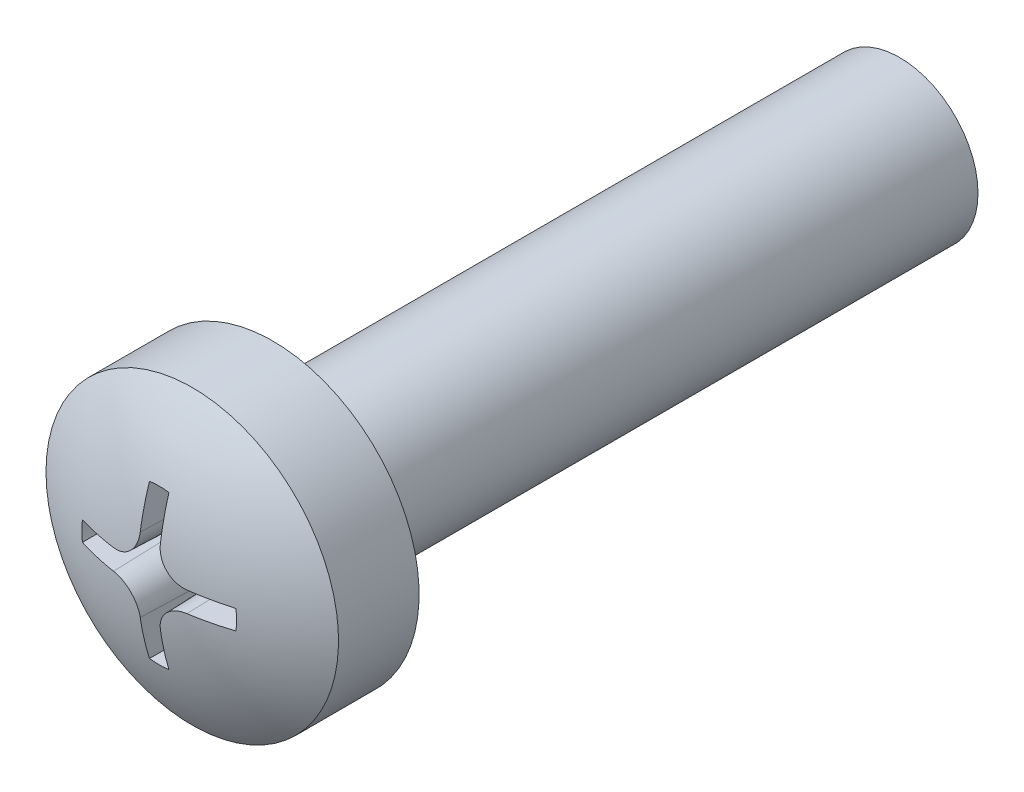
ISO-10303-21;
HEADER;
FILE_DESCRIPTION(('STEP AP214'),'2;1');
FILE_NAME('part.step','',(''),(''),'','','');
FILE_SCHEMA(('AUTOMOTIVE_DESIGN { 1 0 10303 214 1 1 1 1 }'));
ENDSEC;
DATA;
#1=APPLICATION_CONTEXT('core data for automotive mechanical design processes');
#2=APPLICATION_PROTOCOL_DEFINITION('international standard','automotive_design',2000,#1);
#3=PRODUCT_CONTEXT('',#1,'mechanical');
#4=PRODUCT('Part','Part','',(#3));
#5=PRODUCT_RELATED_PRODUCT_CATEGORY('part','',(#4));
#6=PRODUCT_DEFINITION_FORMATION('','',#4);
#7=PRODUCT_DEFINITION_CONTEXT('part definition',#1,'design');
#8=PRODUCT_DEFINITION('design','',#6,#7);
#9=PRODUCT_DEFINITION_SHAPE('','',#8);
#10=(LENGTH_UNIT() NAMED_UNIT(*) SI_UNIT(.MILLI.,.METRE.));
#11=(NAMED_UNIT(*) PLANE_ANGLE_UNIT() SI_UNIT($,.RADIAN.));
#12=(NAMED_UNIT(*) SI_UNIT($,.STERADIAN.) SOLID_ANGLE_UNIT());
#13=UNCERTAINTY_MEASURE_WITH_UNIT(LENGTH_MEASURE(1.E-05),#10,'distance_accuracy_value','');
#14=(GEOMETRIC_REPRESENTATION_CONTEXT(3) GLOBAL_UNCERTAINTY_ASSIGNED_CONTEXT((#13)) GLOBAL_UNIT_ASSIGNED_CONTEXT((#10,
#11,#12)) REPRESENTATION_CONTEXT('',''));
#15=CARTESIAN_POINT('',(0.,0.,0.));
#16=DIRECTION('',(0.,0.,1.));
#17=DIRECTION('',(1.,0.,0.));
#18=AXIS2_PLACEMENT_3D('',#15,#16,#17);
#19=CARTESIAN_POINT('',(0.,0.,12.));
#20=DIRECTION('',(0.,0.,-1.));
#21=DIRECTION('',(-1.,0.,0.));
#22=AXIS2_PLACEMENT_3D('',#19,#20,#21);
#23=CYLINDRICAL_SURFACE('',#22,1.5);
#24=CARTESIAN_POINT('',(0.,0.,12.));
#25=DIRECTION('',(0.,0.,1.));
#26=DIRECTION('',(1.,0.,0.));
#27=AXIS2_PLACEMENT_3D('',#24,#25,#26);
#28=CIRCLE('',#27,1.5);
#29=CARTESIAN_POINT('',(1.5,0.,12.));
#30=VERTEX_POINT('',#29);
#31=EDGE_CURVE('E208',#30,#30,#28,.T.);
#32=ORIENTED_EDGE('',*,*,#31,.F.);
#33=EDGE_LOOP('',(#32));
#34=FACE_BOUND('',#33,.T.);
#35=CARTESIAN_POINT('',(0.,0.,-0.0001));
#36=DIRECTION('',(0.,0.,1.));
#37=DIRECTION('',(1.,0.,0.));
#38=AXIS2_PLACEMENT_3D('',#35,#36,#37);
#39=CIRCLE('',#38,1.5);
#40=CARTESIAN_POINT('',(1.5,0.,-0.0001));
#41=VERTEX_POINT('',#40);
#42=EDGE_CURVE('E205',#41,#41,#39,.T.);
#43=ORIENTED_EDGE('',*,*,#42,.T.);
#44=EDGE_LOOP('',(#43));
#45=FACE_BOUND('',#44,.T.);
#46=ADVANCED_FACE('F34',(#34,#45),#23,.T.);
#47=CARTESIAN_POINT('',(0.,0.,-0.0001));
#48=DIRECTION('',(0.,0.,1.));
#49=DIRECTION('',(1.,0.,0.));
#50=AXIS2_PLACEMENT_3D('',#47,#48,#49);
#51=PLANE('',#50);
#52=ORIENTED_EDGE('',*,*,#42,.F.);
#53=EDGE_LOOP('',(#52));
#54=FACE_BOUND('',#53,.T.);
#55=ADVANCED_FACE('F295',(#54),#51,.F.);
#56=CARTESIAN_POINT('',(0.,0.,12.));
#57=DIRECTION('',(0.,0.,-1.));
#58=DIRECTION('',(-1.,0.,0.));
#59=AXIS2_PLACEMENT_3D('',#56,#57,#58);
#60=PLANE('',#59);
#61=ORIENTED_EDGE('',*,*,#31,.T.);
#62=EDGE_LOOP('',(#61));
#63=FACE_BOUND('',#62,.T.);
#64=CARTESIAN_POINT('',(0.,0.,12.));
#65=DIRECTION('',(0.,0.,-1.));
#66=DIRECTION('',(-1.,0.,0.));
#67=AXIS2_PLACEMENT_3D('',#64,#65,#66);
#68=CIRCLE('',#67,2.79999990016222);
#69=CARTESIAN_POINT('',(-2.79999990016222,0.,12.));
#70=VERTEX_POINT('',#69);
#71=EDGE_CURVE('E202',#70,#70,#68,.T.);
#72=ORIENTED_EDGE('',*,*,#71,.T.);
#73=EDGE_LOOP('',(#72));
#74=FACE_BOUND('',#73,.T.);
#75=ADVANCED_FACE('F300',(#63,#74),#60,.T.);
#76=CARTESIAN_POINT('',(0.,0.,-0.393620134621003));
#77=DIRECTION('',(0.,0.,-1.));
#78=DIRECTION('',(-1.,0.,0.));
#79=AXIS2_PLACEMENT_3D('',#76,#77,#78);
#80=CYLINDRICAL_SURFACE('',#79,2.79999990016222);
#81=CARTESIAN_POINT('',(0.,0.,13.5424630797893));
#82=DIRECTION('',(0.,0.,-1.));
#83=DIRECTION('',(-1.,0.,0.));
#84=AXIS2_PLACEMENT_3D('',#81,#82,#83);
#85=CIRCLE('',#84,2.79999990016222);
#86=CARTESIAN_POINT('',(-2.79999990016222,0.,13.5424630797893));
#87=VERTEX_POINT('',#86);
#88=EDGE_CURVE('E150',#87,#87,#85,.T.);
#89=ORIENTED_EDGE('',*,*,#88,.T.);
#90=EDGE_LOOP('',(#89));
#91=FACE_BOUND('',#90,.T.);
#92=ORIENTED_EDGE('',*,*,#71,.F.);
#93=EDGE_LOOP('',(#92));
#94=FACE_BOUND('',#93,.T.);
#95=ADVANCED_FACE('F308',(#91,#94),#80,.T.);
#96=CARTESIAN_POINT('',(0.,0.,9.40000011175871));
#97=DIRECTION('',(0.,0.,-1.));
#98=DIRECTION('',(1.,0.,0.));
#99=AXIS2_PLACEMENT_3D('',#96,#97,#98);
#100=SPHERICAL_SURFACE('',#99,4.99999988824129);
#101=CARTESIAN_POINT('',(0.,0.,14.1754183821502));
#102=DIRECTION('',(0.,0.,-1.));
#103=DIRECTION('',(-1.,0.,0.));
#104=AXIS2_PLACEMENT_3D('',#101,#102,#103);
#105=CIRCLE('',#104,1.4816812157899);
#106=CARTESIAN_POINT('',(0.18668120666759,1.46987392394782,14.1754183821501));
#107=VERTEX_POINT('',#106);
#108=CARTESIAN_POINT('',(-0.186681206667593,1.46987392394782,14.1754183821501));
#109=VERTEX_POINT('',#108);
#110=EDGE_CURVE('E11',#107,#109,#105,.F.);
#111=ORIENTED_EDGE('',*,*,#110,.F.);
#112=CARTESIAN_POINT('',(0.0198956640512633,0.,9.39930533986049));
#113=DIRECTION('',(0.999390827019096,0.,-0.034899496702501));
#114=DIRECTION('',(-0.034899496702501,0.,-0.999390827019096));
#115=AXIS2_PLACEMENT_3D('',#112,#113,#114);
#116=CIRCLE('',#115,4.99996025606773);
#117=CARTESIAN_POINT('',(0.192632610704328,0.708178557647151,14.3458442955351));
#118=VERTEX_POINT('',#117);
#119=EDGE_CURVE('E41',#107,#118,#116,.T.);
#120=ORIENTED_EDGE('',*,*,#119,.T.);
#121=CARTESIAN_POINT('',(0.192631650862954,0.708378557647151,14.345815691475));
#122=CARTESIAN_POINT('',(0.192737639690806,0.679822741796073,14.3499041439734));
#123=CARTESIAN_POINT('',(0.195268867839181,0.651227392830896,14.3536463362414));
#124=CARTESIAN_POINT('',(0.205046889209158,0.59476703827459,14.3603460551712));
#125=CARTESIAN_POINT('',(0.212292618678018,0.566901869404939,14.3633037586285));
#126=CARTESIAN_POINT('',(0.231373694375068,0.51267267841366,14.3683466063254));
#127=CARTESIAN_POINT('',(0.24321326807329,0.486310064716558,14.3704309431667));
#128=CARTESIAN_POINT('',(0.271156607880554,0.435900324544809,14.3736603491012));
#129=CARTESIAN_POINT('',(0.287258672100205,0.411852279143786,14.3748057923215));
#130=CARTESIAN_POINT('',(0.323072075489885,0.367028886470806,14.3761158025717));
#131=CARTESIAN_POINT('',(0.342740648168188,0.346219679514825,14.3762912893596));
#132=CARTESIAN_POINT('',(0.385246757538768,0.30814670944778,14.3756853456951));
#133=CARTESIAN_POINT('',(0.408084792807392,0.290883505206881,14.3749037645383));
#134=CARTESIAN_POINT('',(0.456147210008961,0.260464262414973,14.3724133951705));
#135=CARTESIAN_POINT('',(0.481359759209805,0.247289131136679,14.3707090224733));
#136=CARTESIAN_POINT('',(0.533541444049374,0.225283958921734,14.3664258870809));
#137=CARTESIAN_POINT('',(0.560509920861877,0.216452298826715,14.3638474508254));
#138=CARTESIAN_POINT('',(0.606876295057338,0.205379627868596,14.3588207651558));
#139=CARTESIAN_POINT('',(0.626020977094074,0.201943221890059,14.3565812960749));
#140=CARTESIAN_POINT('',(0.66450204404321,0.197253494550336,14.3517582366185));
#141=CARTESIAN_POINT('',(0.683838077649067,0.195996727127303,14.349175196413));
#142=CARTESIAN_POINT('',(0.703167546290468,0.195835015722445,14.3464334662955));
#143=B_SPLINE_CURVE_WITH_KNOTS('',3,(#121,#122,#123,#124,#125,#126,#127,#128,#129,#130,#131,
#132,#133,#134,#135,#136,#137,#138,#139,#140,#141,#142),.UNSPECIFIED.,.F.,.F.,(4,2,2,2,2,2,2,2,
2,2,4),(0.,0.0864417829586744,0.172864068455127,0.259366073122684,0.345833591994609,
0.431325646912079,0.516831165542016,0.601931114274005,0.686999315371811,0.745618262708562,
0.804144447281415),.UNSPECIFIED.);
#144=CARTESIAN_POINT('',(0.702917362553185,0.19583721033533,14.3464689381926));
#145=VERTEX_POINT('',#144);
#146=EDGE_CURVE('E277',#118,#145,#143,.T.);
#147=ORIENTED_EDGE('',*,*,#146,.T.);
#148=CARTESIAN_POINT('',(0.000105390153350327,0.0259265633149154,9.39909472873738));
#149=DIRECTION('',(0.00406243901494415,0.999382570249833,-0.034899496702501));
#150=DIRECTION('',(0.,0.0348997846864301,0.999390816962434));
#151=AXIS2_PLACEMENT_3D('',#148,#149,#150);
#152=CIRCLE('',#151,4.99993258603575);
#153=CARTESIAN_POINT('',(1.46986565043204,0.186746338396853,14.1754183821502));
#154=VERTEX_POINT('',#153);
#155=EDGE_CURVE('E275',#154,#145,#152,.F.);
#156=ORIENTED_EDGE('',*,*,#155,.F.);
#157=CARTESIAN_POINT('',(0.,0.,14.1754183821502));
#158=DIRECTION('',(0.,0.,-1.));
#159=DIRECTION('',(-1.,0.,0.));
#160=AXIS2_PLACEMENT_3D('',#157,#158,#159);
#161=CIRCLE('',#160,1.4816812157899);
#162=CARTESIAN_POINT('',(1.46986565043204,-0.186746338396852,14.1754183821501));
#163=VERTEX_POINT('',#162);
#164=EDGE_CURVE('E273',#163,#154,#161,.F.);
#165=ORIENTED_EDGE('',*,*,#164,.F.);
#166=CARTESIAN_POINT('',(0.000105390153350358,-0.0259265633149169,9.39909472873738));
#167=DIRECTION('',(0.00406243901494512,-0.999382570249833,-0.034899496702501));
#168=DIRECTION('',(0.,0.0348997846864301,-0.999390816962434));
#169=AXIS2_PLACEMENT_3D('',#166,#167,#168);
#170=CIRCLE('',#169,4.99993258603575);
#171=CARTESIAN_POINT('',(0.702917362553185,-0.195837210335331,14.3464689381926));
#172=VERTEX_POINT('',#171);
#173=EDGE_CURVE('E270',#163,#172,#170,.T.);
#174=ORIENTED_EDGE('',*,*,#173,.T.);
#175=CARTESIAN_POINT('',(0.192631650862954,-0.708378557647152,14.345815691475));
#176=CARTESIAN_POINT('',(0.192737639690806,-0.679822741796074,14.3499041439734));
#177=CARTESIAN_POINT('',(0.195268867839181,-0.651227392830896,14.3536463362414));
#178=CARTESIAN_POINT('',(0.205046889209158,-0.59476703827459,14.3603460551712));
#179=CARTESIAN_POINT('',(0.212292618678018,-0.56690186940494,14.3633037586285));
#180=CARTESIAN_POINT('',(0.231373694375068,-0.512672678413661,14.3683466063254));
#181=CARTESIAN_POINT('',(0.24321326807329,-0.486310064716559,14.3704309431667));
#182=CARTESIAN_POINT('',(0.271156607880554,-0.435900324544809,14.3736603491012));
#183=CARTESIAN_POINT('',(0.287258672100205,-0.411852279143786,14.3748057923215));
#184=CARTESIAN_POINT('',(0.323072075489885,-0.367028886470807,14.3761158025717));
#185=CARTESIAN_POINT('',(0.342740648168188,-0.346219679514826,14.3762912893596));
#186=CARTESIAN_POINT('',(0.385246757538768,-0.308146709447781,14.3756853456951));
#187=CARTESIAN_POINT('',(0.408084792807392,-0.290883505206882,14.3749037645383));
#188=CARTESIAN_POINT('',(0.456147210008961,-0.260464262414974,14.3724133951705));
#189=CARTESIAN_POINT('',(0.481359759209805,-0.247289131136679,14.3707090224733));
#190=CARTESIAN_POINT('',(0.533541444049374,-0.225283958921735,14.3664258870809));
#191=CARTESIAN_POINT('',(0.560509920861878,-0.216452298826716,14.3638474508254));
#192=CARTESIAN_POINT('',(0.606876295057338,-0.205379627868597,14.3588207651558));
#193=CARTESIAN_POINT('',(0.626020977094074,-0.201943221890059,14.3565812960749));
#194=CARTESIAN_POINT('',(0.66450204404321,-0.197253494550336,14.3517582366185));
#195=CARTESIAN_POINT('',(0.683838077649067,-0.195996727127304,14.349175196413));
#196=CARTESIAN_POINT('',(0.703167546290467,-0.195835015722445,14.3464334662955));
#197=B_SPLINE_CURVE_WITH_KNOTS('',3,(#175,#176,#177,#178,#179,#180,#181,#182,#183,#184,#185,
#186,#187,#188,#189,#190,#191,#192,#193,#194,#195,#196),.UNSPECIFIED.,.F.,.F.,(4,2,2,2,2,2,2,2,
2,2,4),(0.,0.0864417829586746,0.172864068455127,0.259366073122684,0.345833591994609,
0.431325646912079,0.516831165542017,0.601931114274005,0.686999315371811,0.745618262708562,
0.804144447281414),.UNSPECIFIED.);
#198=CARTESIAN_POINT('',(0.192632610704328,-0.708178557647152,14.3458442955351));
#199=VERTEX_POINT('',#198);
#200=EDGE_CURVE('E264',#199,#172,#197,.T.);
#201=ORIENTED_EDGE('',*,*,#200,.F.);
#202=CARTESIAN_POINT('',(0.0198956640512633,0.,9.39930533986049));
#203=DIRECTION('',(0.999390827019096,0.,-0.034899496702501));
#204=DIRECTION('',(-0.034899496702501,0.,-0.999390827019096));
#205=AXIS2_PLACEMENT_3D('',#202,#203,#204);
#206=CIRCLE('',#205,4.99996025606773);
#207=CARTESIAN_POINT('',(0.186681206667591,-1.46987392394782,14.1754183821502));
#208=VERTEX_POINT('',#207);
#209=EDGE_CURVE('E262',#208,#199,#206,.F.);
#210=ORIENTED_EDGE('',*,*,#209,.F.);
#211=CARTESIAN_POINT('',(0.,0.,14.1754183821502));
#212=DIRECTION('',(0.,0.,-1.));
#213=DIRECTION('',(-1.,0.,0.));
#214=AXIS2_PLACEMENT_3D('',#211,#212,#213);
#215=CIRCLE('',#214,1.4816812157899);
#216=CARTESIAN_POINT('',(-0.186681206667593,-1.46987392394782,14.1754183821501));
#217=VERTEX_POINT('',#216);
#218=EDGE_CURVE('E259',#208,#217,#215,.T.);
#219=ORIENTED_EDGE('',*,*,#218,.T.);
#220=CARTESIAN_POINT('',(-0.0198956640512654,0.,9.39930533986049));
#221=DIRECTION('',(-0.999390827019096,0.,-0.034899496702501));
#222=DIRECTION('',(-0.034899496702501,0.,0.999390827019096));
#223=AXIS2_PLACEMENT_3D('',#220,#221,#222);
#224=CIRCLE('',#223,4.99996025606773);
#225=CARTESIAN_POINT('',(-0.19263261070433,-0.708178557647151,14.3458442955351));
#226=VERTEX_POINT('',#225);
#227=EDGE_CURVE('E255',#217,#226,#224,.T.);
#228=ORIENTED_EDGE('',*,*,#227,.T.);
#229=CARTESIAN_POINT('',(-0.703167546290469,-0.195835015722445,14.3464334662955));
#230=CARTESIAN_POINT('',(-0.674619447950853,-0.196052963217916,14.3504857241648));
#231=CARTESIAN_POINT('',(-0.646041434637229,-0.198695168407334,14.3541890416191));
#232=CARTESIAN_POINT('',(-0.589634494727846,-0.208689654905481,14.3608068014756));
#233=CARTESIAN_POINT('',(-0.561805393198952,-0.216040826152063,14.3637214295682));
#234=CARTESIAN_POINT('',(-0.50766612082123,-0.235323893103952,14.3686750861046));
#235=CARTESIAN_POINT('',(-0.481357369172764,-0.247259991703852,14.370713307523));
#236=CARTESIAN_POINT('',(-0.431071022991568,-0.275383990623327,14.3738489099634));
#237=CARTESIAN_POINT('',(-0.407092510169895,-0.291570206692359,14.3749466629444));
#238=CARTESIAN_POINT('',(-0.362416703115866,-0.327538701485095,14.3761618083202));
#239=CARTESIAN_POINT('',(-0.34168588735275,-0.34727899131776,14.376289966384));
#240=CARTESIAN_POINT('',(-0.303780328011577,-0.389912448398922,14.375590364716));
#241=CARTESIAN_POINT('',(-0.286606147147996,-0.412806113607388,14.3747624538554));
#242=CARTESIAN_POINT('',(-0.25636685808405,-0.46096947591693,14.3721816258056));
#243=CARTESIAN_POINT('',(-0.243283863198686,-0.486228184526672,14.3704328274806));
#244=CARTESIAN_POINT('',(-0.22146899790456,-0.538485231439468,14.366063898297));
#245=CARTESIAN_POINT('',(-0.212735526227358,-0.565482925398505,14.3634440886927));
#246=CARTESIAN_POINT('',(-0.201823996880683,-0.61191361527353,14.3583478129874));
#247=CARTESIAN_POINT('',(-0.198453223120025,-0.631098599357625,14.3560784464194));
#248=CARTESIAN_POINT('',(-0.193901764340931,-0.669652448873598,14.3511968730386));
#249=CARTESIAN_POINT('',(-0.192717622166764,-0.689020975292663,14.3485852144187));
#250=CARTESIAN_POINT('',(-0.192631650862956,-0.708378557647151,14.345815691475));
#251=B_SPLINE_CURVE_WITH_KNOTS('',3,(#229,#230,#231,#232,#233,#234,#235,#236,#237,#238,#239,
#240,#241,#242,#243,#244,#245,#246,#247,#248,#249,#250),.UNSPECIFIED.,.F.,.F.,(4,2,2,2,2,2,2,2,
2,2,4),(0.,0.0864053436114192,0.17279032606061,0.259254685287909,0.345684831711331,
0.431153892876567,0.51663646625136,0.601739908197797,0.686811996276178,0.745524819849982,
0.804144736260156),.UNSPECIFIED.);
#252=CARTESIAN_POINT('',(-0.702917362553187,-0.195837210335331,14.3464689381926));
#253=VERTEX_POINT('',#252);
#254=EDGE_CURVE('E248',#253,#226,#251,.T.);
#255=ORIENTED_EDGE('',*,*,#254,.F.);
#256=CARTESIAN_POINT('',(-0.000105390153349678,-0.0259265633149168,9.39909472873738));
#257=DIRECTION('',(-0.0040624390149453,-0.999382570249833,-0.034899496702501));
#258=DIRECTION('',(0.,0.0348997846864301,-0.999390816962434));
#259=AXIS2_PLACEMENT_3D('',#256,#257,#258);
#260=CIRCLE('',#259,4.99993258603575);
#261=CARTESIAN_POINT('',(-1.46986565043204,-0.186746338396853,14.1754183821502));
#262=VERTEX_POINT('',#261);
#263=EDGE_CURVE('E256',#262,#253,#260,.F.);
#264=ORIENTED_EDGE('',*,*,#263,.F.);
#265=CARTESIAN_POINT('',(0.,0.,14.1754183821502));
#266=DIRECTION('',(0.,0.,-1.));
#267=DIRECTION('',(-1.,0.,0.));
#268=AXIS2_PLACEMENT_3D('',#265,#266,#267);
#269=CIRCLE('',#268,1.4816812157899);
#270=CARTESIAN_POINT('',(-1.46986565043204,0.186746338396852,14.1754183821501));
#271=VERTEX_POINT('',#270);
#272=EDGE_CURVE('E594',#262,#271,#269,.T.);
#273=ORIENTED_EDGE('',*,*,#272,.T.);
#274=CARTESIAN_POINT('',(-0.000105390153349678,0.0259265633149168,9.39909472873738));
#275=DIRECTION('',(-0.00406243901494529,0.999382570249833,-0.034899496702501));
#276=DIRECTION('',(0.,0.0348997846864301,0.999390816962434));
#277=AXIS2_PLACEMENT_3D('',#274,#275,#276);
#278=CIRCLE('',#277,4.99993258603575);
#279=CARTESIAN_POINT('',(-0.702917362553187,0.195837210335331,14.3464689381926));
#280=VERTEX_POINT('',#279);
#281=EDGE_CURVE('E221',#271,#280,#278,.T.);
#282=ORIENTED_EDGE('',*,*,#281,.T.);
#283=CARTESIAN_POINT('',(-0.192631650862955,0.708378557647151,14.345815691475));
#284=CARTESIAN_POINT('',(-0.192737639690808,0.679822741796074,14.3499041439734));
#285=CARTESIAN_POINT('',(-0.195268867839183,0.651227392830896,14.3536463362414));
#286=CARTESIAN_POINT('',(-0.20504688920916,0.59476703827459,14.3603460551712));
#287=CARTESIAN_POINT('',(-0.21229261867802,0.566901869404939,14.3633037586285));
#288=CARTESIAN_POINT('',(-0.231373694375069,0.51267267841366,14.3683466063254));
#289=CARTESIAN_POINT('',(-0.243213268073292,0.486310064716559,14.3704309431667));
#290=CARTESIAN_POINT('',(-0.271156607880555,0.435900324544809,14.3736603491012));
#291=CARTESIAN_POINT('',(-0.287258672100206,0.411852279143786,14.3748057923215));
#292=CARTESIAN_POINT('',(-0.323072075489887,0.367028886470806,14.3761158025717));
#293=CARTESIAN_POINT('',(-0.34274064816819,0.346219679514826,14.3762912893596));
#294=CARTESIAN_POINT('',(-0.38524675753877,0.30814670944778,14.3756853456951));
#295=CARTESIAN_POINT('',(-0.408084792807394,0.290883505206882,14.3749037645383));
#296=CARTESIAN_POINT('',(-0.456147210008963,0.260464262414974,14.3724133951705));
#297=CARTESIAN_POINT('',(-0.481359759209807,0.247289131136679,14.3707090224733));
#298=CARTESIAN_POINT('',(-0.533541444049376,0.225283958921735,14.3664258870809));
#299=CARTESIAN_POINT('',(-0.560509920861879,0.216452298826716,14.3638474508254));
#300=CARTESIAN_POINT('',(-0.60687629505734,0.205379627868597,14.3588207651558));
#301=CARTESIAN_POINT('',(-0.626020977094076,0.201943221890059,14.3565812960749));
#302=CARTESIAN_POINT('',(-0.664502044043212,0.197253494550336,14.3517582366185));
#303=CARTESIAN_POINT('',(-0.683838077649068,0.195996727127304,14.349175196413));
#304=CARTESIAN_POINT('',(-0.703167546290469,0.195835015722445,14.3464334662955));
#305=B_SPLINE_CURVE_WITH_KNOTS('',3,(#283,#284,#285,#286,#287,#288,#289,#290,#291,#292,#293,
#294,#295,#296,#297,#298,#299,#300,#301,#302,#303,#304),.UNSPECIFIED.,.F.,.F.,(4,2,2,2,2,2,2,2,
2,2,4),(0.,0.0864417829586746,0.172864068455127,0.259366073122684,0.345833591994609,
0.431325646912079,0.516831165542016,0.601931114274004,0.68699931537181,0.745618262708561,
0.804144447281414),.UNSPECIFIED.);
#306=CARTESIAN_POINT('',(-0.19263261070433,0.708178557647151,14.3458442955351));
#307=VERTEX_POINT('',#306);
#308=EDGE_CURVE('E213',#307,#280,#305,.T.);
#309=ORIENTED_EDGE('',*,*,#308,.F.);
#310=CARTESIAN_POINT('',(-0.0198956640512644,0.,9.39930533986049));
#311=DIRECTION('',(-0.999390827019096,0.,-0.034899496702501));
#312=DIRECTION('',(-0.034899496702501,0.,0.999390827019096));
#313=AXIS2_PLACEMENT_3D('',#310,#311,#312);
#314=CIRCLE('',#313,4.99996025606773);
#315=EDGE_CURVE('E211',#109,#307,#314,.F.);
#316=ORIENTED_EDGE('',*,*,#315,.F.);
#317=EDGE_LOOP('',(#111,#120,#147,#156,#165,#174,#201,#210,#219,#228,#255,#264,#273,#282,#309,#316));
#318=FACE_BOUND('',#317,.T.);
#319=ORIENTED_EDGE('',*,*,#88,.F.);
#320=EDGE_LOOP('',(#319));
#321=FACE_BOUND('',#320,.T.);
#322=ADVANCED_FACE('F223',(#318,#321),#100,.T.);
#323=CARTESIAN_POINT('',(0.,0.,14.7000001));
#324=DIRECTION('',(0.,0.,1.));
#325=DIRECTION('',(1.,0.,0.));
#326=AXIS2_PLACEMENT_3D('',#323,#324,#325);
#327=CONICAL_SURFACE('',#326,1.50000001303852,0.0349065850398867);
#328=ORIENTED_EDGE('',*,*,#110,.T.);
#329=CARTESIAN_POINT('',(-0.142142619910814,1.43009594495933,12.9000001309199));
#330=CARTESIAN_POINT('',(-0.152618658076336,1.43957885994155,13.1999946132293));
#331=CARTESIAN_POINT('',(-0.163094792502732,1.4489727928664,13.4999918520894));
#332=CARTESIAN_POINT('',(-0.184047253837866,1.46758269456637,14.0999918417828));
#333=CARTESIAN_POINT('',(-0.194523580746602,1.47679866334215,14.399994592616));
#334=CARTESIAN_POINT('',(-0.205000003916213,1.48592565006124,14.7000001));
#335=B_SPLINE_CURVE_WITH_KNOTS('',3,(#329,#330,#331,#332,#333,#334),.UNSPECIFIED.,.F.,.F.,(4,2,
4),(0.,0.900981158642231,1.80196231389533),.UNSPECIFIED.);
#336=CARTESIAN_POINT('',(-0.142142619910814,1.43009594495933,12.9000001309199));
#337=VERTEX_POINT('',#336);
#338=EDGE_CURVE('E48',#337,#109,#335,.T.);
#339=ORIENTED_EDGE('',*,*,#338,.F.);
#340=CARTESIAN_POINT('',(0.,0.,12.9000001309199));
#341=DIRECTION('',(0.,0.,1.));
#342=DIRECTION('',(1.,0.,0.));
#343=AXIS2_PLACEMENT_3D('',#340,#341,#342);
#344=CIRCLE('',#343,1.43714262903312);
#345=CARTESIAN_POINT('',(0.142142619910811,1.43009594495933,12.9000001309199));
#346=VERTEX_POINT('',#345);
#347=EDGE_CURVE('E158',#346,#337,#344,.T.);
#348=ORIENTED_EDGE('',*,*,#347,.F.);
#349=CARTESIAN_POINT('',(0.142142619910811,1.43009594495933,12.9000001309199));
#350=CARTESIAN_POINT('',(0.152618658076333,1.43957885994155,13.1999946132293));
#351=CARTESIAN_POINT('',(0.16309479250273,1.4489727928664,13.4999918520894));
#352=CARTESIAN_POINT('',(0.184047253837863,1.46758269456637,14.0999918417828));
#353=CARTESIAN_POINT('',(0.1945235807466,1.47679866334215,14.399994592616));
#354=CARTESIAN_POINT('',(0.205000003916211,1.48592565006124,14.7000001));
#355=B_SPLINE_CURVE_WITH_KNOTS('',3,(#349,#350,#351,#352,#353,#354),.UNSPECIFIED.,.F.,.F.,(4,2,
4),(0.,0.900981158642231,1.80196231389533),.UNSPECIFIED.);
#356=EDGE_CURVE('E142',#346,#107,#355,.T.);
#357=ORIENTED_EDGE('',*,*,#356,.T.);
#358=EDGE_LOOP('',(#328,#339,#348,#357));
#359=FACE_BOUND('',#358,.T.);
#360=ADVANCED_FACE('F162',(#359),#327,.F.);
#361=CARTESIAN_POINT('',(0.205000003916211,1.48592565006124,14.7000001));
#362=DIRECTION('',(0.999390827019096,0.,-0.034899496702501));
#363=DIRECTION('',(-0.034899496702501,0.,-0.999390827019096));
#364=AXIS2_PLACEMENT_3D('',#361,#362,#363);
#365=PLANE('',#364);
#366=ORIENTED_EDGE('',*,*,#356,.F.);
#367=DIRECTION('',(0.,1.,0.));
#368=VECTOR('',#367,1.);
#369=CARTESIAN_POINT('',(0.142142619910812,0.,12.9000001309199));
#370=LINE('',#369,#368);
#371=CARTESIAN_POINT('',(0.142142619910811,0.708178557647151,12.9000001309199));
#372=VERTEX_POINT('',#371);
#373=EDGE_CURVE('E145',#346,#372,#370,.F.);
#374=ORIENTED_EDGE('',*,*,#373,.T.);
#375=DIRECTION('',(0.034899496702501,0.,0.999390827019096));
#376=VECTOR('',#375,1.);
#377=CARTESIAN_POINT('',(0.20500000391621,0.708178557647151,14.7000001));
#378=LINE('',#377,#376);
#379=EDGE_CURVE('E151',#372,#118,#378,.T.);
#380=ORIENTED_EDGE('',*,*,#379,.T.);
#381=ORIENTED_EDGE('',*,*,#119,.F.);
#382=EDGE_LOOP('',(#366,#374,#380,#381));
#383=FACE_BOUND('',#382,.T.);
#384=ADVANCED_FACE('F144',(#383),#365,.F.);
#385=CARTESIAN_POINT('',(0.705000003916211,0.708178557647151,14.7000001));
#386=DIRECTION('',(0.,0.,-1.));
#387=DIRECTION('',(1.,0.,0.));
#388=AXIS2_PLACEMENT_3D('',#385,#386,#387);
#389=CONICAL_SURFACE('',#388,0.5,0.0349065850398867);
#390=ORIENTED_EDGE('',*,*,#379,.F.);
#391=CARTESIAN_POINT('',(0.705000003916211,0.708178557647151,12.9000001309199));
#392=DIRECTION('',(0.,0.,1.));
#393=DIRECTION('',(1.,0.,0.));
#394=AXIS2_PLACEMENT_3D('',#391,#392,#393);
#395=CIRCLE('',#394,0.562857384005399);
#396=CARTESIAN_POINT('',(0.702712036351556,0.145325823858085,12.9000001309199));
#397=VERTEX_POINT('',#396);
#398=EDGE_CURVE('E160',#372,#397,#395,.T.);
#399=ORIENTED_EDGE('',*,*,#398,.T.);
#400=DIRECTION('',(0.000141863496415148,0.0348992083697649,0.999390827019096));
#401=VECTOR('',#400,1.);
#402=CARTESIAN_POINT('',(0.702967546290468,0.208182688548215,14.7000001));
#403=LINE('',#402,#401);
#404=EDGE_CURVE('E418',#397,#145,#403,.T.);
#405=ORIENTED_EDGE('',*,*,#404,.T.);
#406=ORIENTED_EDGE('',*,*,#146,.F.);
#407=EDGE_LOOP('',(#390,#399,#405,#406));
#408=FACE_BOUND('',#407,.T.);
#409=ADVANCED_FACE('F283',(#408),#389,.T.);
#410=CARTESIAN_POINT('',(1.48592565006123,0.205000003916213,14.7000001));
#411=DIRECTION('',(0.00406243901494415,0.999382570249833,-0.034899496702501));
#412=DIRECTION('',(0.,0.0348997846864301,0.999390816962434));
#413=AXIS2_PLACEMENT_3D('',#410,#411,#412);
#414=PLANE('',#413);
#415=ORIENTED_EDGE('',*,*,#155,.T.);
#416=ORIENTED_EDGE('',*,*,#404,.F.);
#417=DIRECTION('',(-0.99999173819787,0.00406491525148502,0.));
#418=VECTOR('',#417,1.);
#419=CARTESIAN_POINT('',(0.000602343564913371,0.148179863836023,12.9000001309199));
#420=LINE('',#419,#418);
#421=CARTESIAN_POINT('',(1.43007341244828,0.142369137079488,12.9000001309199));
#422=VERTEX_POINT('',#421);
#423=EDGE_CURVE('E171',#422,#397,#420,.T.);
#424=ORIENTED_EDGE('',*,*,#423,.F.);
#425=CARTESIAN_POINT('',(1.43007341244828,0.142369137079488,12.9000001309199));
#426=CARTESIAN_POINT('',(1.43955869120937,0.152806706922151,13.1999946790441));
#427=CARTESIAN_POINT('',(1.44895568373278,0.163244730756208,13.4999919508073));
#428=CARTESIAN_POINT('',(1.46757309626977,0.184121686368453,14.0999919405007));
#429=CARTESIAN_POINT('',(1.47679351628402,0.194560618146638,14.3999946584309));
#430=CARTESIAN_POINT('',(1.48592565006123,0.205000003916213,14.7000001));
#431=B_SPLINE_CURVE_WITH_KNOTS('',3,(#425,#426,#427,#428,#429,#430),.UNSPECIFIED.,.F.,.F.,(4,2,
4),(0.,0.900977563471273,1.80195512360615),.UNSPECIFIED.);
#432=EDGE_CURVE('E412',#422,#154,#431,.T.);
#433=ORIENTED_EDGE('',*,*,#432,.T.);
#434=EDGE_LOOP('',(#415,#416,#424,#433));
#435=FACE_BOUND('',#434,.T.);
#436=ADVANCED_FACE('F235',(#435),#414,.F.);
#437=CARTESIAN_POINT('',(0.,0.,14.7000001));
#438=DIRECTION('',(0.,0.,1.));
#439=DIRECTION('',(1.,0.,0.));
#440=AXIS2_PLACEMENT_3D('',#437,#438,#439);
#441=CONICAL_SURFACE('',#440,1.50000001303852,0.0349065850398867);
#442=ORIENTED_EDGE('',*,*,#164,.T.);
#443=ORIENTED_EDGE('',*,*,#432,.F.);
#444=CARTESIAN_POINT('',(0.,0.,12.9000001309199));
#445=DIRECTION('',(0.,0.,1.));
#446=DIRECTION('',(1.,0.,0.));
#447=AXIS2_PLACEMENT_3D('',#444,#445,#446);
#448=CIRCLE('',#447,1.43714262903312);
#449=CARTESIAN_POINT('',(1.43007341244828,-0.142369137079488,12.9000001309199));
#450=VERTEX_POINT('',#449);
#451=EDGE_CURVE('E173',#450,#422,#448,.T.);
#452=ORIENTED_EDGE('',*,*,#451,.F.);
#453=CARTESIAN_POINT('',(1.43007341244828,-0.142369137079488,12.9000001309199));
#454=CARTESIAN_POINT('',(1.43955869120937,-0.152806706922151,13.1999946790441));
#455=CARTESIAN_POINT('',(1.44895568373278,-0.163244730756208,13.4999919508073));
#456=CARTESIAN_POINT('',(1.46757309626977,-0.184121686368453,14.0999919405007));
#457=CARTESIAN_POINT('',(1.47679351628402,-0.194560618146638,14.3999946584309));
#458=CARTESIAN_POINT('',(1.48592565006123,-0.205000003916213,14.7000001));
#459=B_SPLINE_CURVE_WITH_KNOTS('',3,(#453,#454,#455,#456,#457,#458),.UNSPECIFIED.,.F.,.F.,(4,2,
4),(0.,0.900977563471273,1.80195512360615),.UNSPECIFIED.);
#460=EDGE_CURVE('E406',#450,#163,#459,.T.);
#461=ORIENTED_EDGE('',*,*,#460,.T.);
#462=EDGE_LOOP('',(#442,#443,#452,#461));
#463=FACE_BOUND('',#462,.T.);
#464=ADVANCED_FACE('F291',(#463),#441,.F.);
#465=CARTESIAN_POINT('',(1.48592565006123,-0.205000003916213,14.7000001));
#466=DIRECTION('',(0.00406243901494512,-0.999382570249833,-0.034899496702501));
#467=DIRECTION('',(0.,0.0348997846864301,-0.999390816962434));
#468=AXIS2_PLACEMENT_3D('',#465,#466,#467);
#469=PLANE('',#468);
#470=ORIENTED_EDGE('',*,*,#460,.F.);
#471=DIRECTION('',(0.99999173819787,0.00406491525148599,0.));
#472=VECTOR('',#471,1.);
#473=CARTESIAN_POINT('',(0.00060234356491352,-0.148179863836024,12.9000001309199));
#474=LINE('',#473,#472);
#475=CARTESIAN_POINT('',(0.702712036351556,-0.145325823858086,12.9000001309199));
#476=VERTEX_POINT('',#475);
#477=EDGE_CURVE('E176',#450,#476,#474,.F.);
#478=ORIENTED_EDGE('',*,*,#477,.T.);
#479=DIRECTION('',(0.000141863496415188,-0.0348992083697649,0.999390827019096));
#480=VECTOR('',#479,1.);
#481=CARTESIAN_POINT('',(0.702967546290468,-0.208182688548216,14.7000001));
#482=LINE('',#481,#480);
#483=EDGE_CURVE('E428',#476,#172,#482,.T.);
#484=ORIENTED_EDGE('',*,*,#483,.T.);
#485=ORIENTED_EDGE('',*,*,#173,.F.);
#486=EDGE_LOOP('',(#470,#478,#484,#485));
#487=FACE_BOUND('',#486,.T.);
#488=ADVANCED_FACE('F401',(#487),#469,.F.);
#489=CARTESIAN_POINT('',(0.705000003916211,-0.708178557647152,14.7000001));
#490=DIRECTION('',(0.,0.,-1.));
#491=DIRECTION('',(-1.,0.,0.));
#492=AXIS2_PLACEMENT_3D('',#489,#490,#491);
#493=CONICAL_SURFACE('',#492,0.5,0.0349065850398867);
#494=ORIENTED_EDGE('',*,*,#200,.T.);
#495=ORIENTED_EDGE('',*,*,#483,.F.);
#496=CARTESIAN_POINT('',(0.705000003916211,-0.708178557647152,12.9000001309199));
#497=DIRECTION('',(0.,0.,1.));
#498=DIRECTION('',(1.,0.,0.));
#499=AXIS2_PLACEMENT_3D('',#496,#497,#498);
#500=CIRCLE('',#499,0.562857384005399);
#501=CARTESIAN_POINT('',(0.142142619910812,-0.708178557647152,12.9000001309199));
#502=VERTEX_POINT('',#501);
#503=EDGE_CURVE('E178',#502,#476,#500,.F.);
#504=ORIENTED_EDGE('',*,*,#503,.F.);
#505=DIRECTION('',(0.034899496702501,0.,0.999390827019096));
#506=VECTOR('',#505,1.);
#507=CARTESIAN_POINT('',(0.205000003916211,-0.708178557647152,14.7000001));
#508=LINE('',#507,#506);
#509=EDGE_CURVE('E392',#502,#199,#508,.T.);
#510=ORIENTED_EDGE('',*,*,#509,.T.);
#511=EDGE_LOOP('',(#494,#495,#504,#510));
#512=FACE_BOUND('',#511,.T.);
#513=ADVANCED_FACE('F245',(#512),#493,.T.);
#514=CARTESIAN_POINT('',(0.205000003916211,-1.48592565006124,14.7000001));
#515=DIRECTION('',(0.999390827019096,0.,-0.034899496702501));
#516=DIRECTION('',(-0.034899496702501,0.,-0.999390827019096));
#517=AXIS2_PLACEMENT_3D('',#514,#515,#516);
#518=PLANE('',#517);
#519=ORIENTED_EDGE('',*,*,#209,.T.);
#520=ORIENTED_EDGE('',*,*,#509,.F.);
#521=DIRECTION('',(0.,1.,0.));
#522=VECTOR('',#521,1.);
#523=CARTESIAN_POINT('',(0.142142619910812,0.,12.9000001309199));
#524=LINE('',#523,#522);
#525=CARTESIAN_POINT('',(0.142142619910811,-1.43009594495933,12.9000001309199));
#526=VERTEX_POINT('',#525);
#527=EDGE_CURVE('E181',#526,#502,#524,.T.);
#528=ORIENTED_EDGE('',*,*,#527,.F.);
#529=CARTESIAN_POINT('',(0.142142619910811,-1.43009594495933,12.9000001309199));
#530=CARTESIAN_POINT('',(0.152618658076333,-1.43957885994155,13.1999946132293));
#531=CARTESIAN_POINT('',(0.16309479250273,-1.4489727928664,13.4999918520894));
#532=CARTESIAN_POINT('',(0.184047253837863,-1.46758269456637,14.0999918417828));
#533=CARTESIAN_POINT('',(0.1945235807466,-1.47679866334215,14.399994592616));
#534=CARTESIAN_POINT('',(0.205000003916211,-1.48592565006124,14.7000001));
#535=B_SPLINE_CURVE_WITH_KNOTS('',3,(#529,#530,#531,#532,#533,#534),.UNSPECIFIED.,.F.,.F.,(4,2,
4),(0.,0.900981158642231,1.80196231389533),.UNSPECIFIED.);
#536=EDGE_CURVE('E384',#526,#208,#535,.T.);
#537=ORIENTED_EDGE('',*,*,#536,.T.);
#538=EDGE_LOOP('',(#519,#520,#528,#537));
#539=FACE_BOUND('',#538,.T.);
#540=ADVANCED_FACE('F394',(#539),#518,.F.);
#541=CARTESIAN_POINT('',(0.,0.,14.7000001));
#542=DIRECTION('',(0.,0.,1.));
#543=DIRECTION('',(-1.,0.,0.));
#544=AXIS2_PLACEMENT_3D('',#541,#542,#543);
#545=CONICAL_SURFACE('',#544,1.50000001303852,0.0349065850398867);
#546=ORIENTED_EDGE('',*,*,#536,.F.);
#547=CARTESIAN_POINT('',(0.,0.,12.9000001309199));
#548=DIRECTION('',(0.,0.,1.));
#549=DIRECTION('',(1.,0.,0.));
#550=AXIS2_PLACEMENT_3D('',#547,#548,#549);
#551=CIRCLE('',#550,1.43714262903312);
#552=CARTESIAN_POINT('',(-0.142142619910814,-1.43009594495933,12.9000001309199));
#553=VERTEX_POINT('',#552);
#554=EDGE_CURVE('E184',#526,#553,#551,.F.);
#555=ORIENTED_EDGE('',*,*,#554,.T.);
#556=CARTESIAN_POINT('',(-0.142142619910814,-1.43009594495933,12.9000001309199));
#557=CARTESIAN_POINT('',(-0.152618658076336,-1.43957885994155,13.1999946132293));
#558=CARTESIAN_POINT('',(-0.163094792502732,-1.4489727928664,13.4999918520894));
#559=CARTESIAN_POINT('',(-0.184047253837866,-1.46758269456637,14.0999918417828));
#560=CARTESIAN_POINT('',(-0.194523580746602,-1.47679866334215,14.399994592616));
#561=CARTESIAN_POINT('',(-0.205000003916213,-1.48592565006124,14.7000001));
#562=B_SPLINE_CURVE_WITH_KNOTS('',3,(#556,#557,#558,#559,#560,#561),.UNSPECIFIED.,.F.,.F.,(4,2,
4),(0.,0.900981158642231,1.80196231389533),.UNSPECIFIED.);
#563=EDGE_CURVE('E376',#553,#217,#562,.T.);
#564=ORIENTED_EDGE('',*,*,#563,.T.);
#565=ORIENTED_EDGE('',*,*,#218,.F.);
#566=EDGE_LOOP('',(#546,#555,#564,#565));
#567=FACE_BOUND('',#566,.T.);
#568=ADVANCED_FACE('F371',(#567),#545,.F.);
#569=CARTESIAN_POINT('',(-0.205000003916213,-1.48592565006124,14.7000001));
#570=DIRECTION('',(-0.999390827019096,0.,-0.034899496702501));
#571=DIRECTION('',(-0.034899496702501,0.,0.999390827019096));
#572=AXIS2_PLACEMENT_3D('',#569,#570,#571);
#573=PLANE('',#572);
#574=ORIENTED_EDGE('',*,*,#563,.F.);
#575=DIRECTION('',(0.,-1.,0.));
#576=VECTOR('',#575,1.);
#577=CARTESIAN_POINT('',(-0.142142619910814,0.,12.9000001309199));
#578=LINE('',#577,#576);
#579=CARTESIAN_POINT('',(-0.142142619910814,-0.708178557647151,12.9000001309199));
#580=VERTEX_POINT('',#579);
#581=EDGE_CURVE('E186',#553,#580,#578,.F.);
#582=ORIENTED_EDGE('',*,*,#581,.T.);
#583=DIRECTION('',(-0.034899496702501,0.,0.999390827019096));
#584=VECTOR('',#583,1.);
#585=CARTESIAN_POINT('',(-0.205000003916213,-0.708178557647151,14.7000001));
#586=LINE('',#585,#584);
#587=EDGE_CURVE('E385',#580,#226,#586,.T.);
#588=ORIENTED_EDGE('',*,*,#587,.T.);
#589=ORIENTED_EDGE('',*,*,#227,.F.);
#590=EDGE_LOOP('',(#574,#582,#588,#589));
#591=FACE_BOUND('',#590,.T.);
#592=ADVANCED_FACE('F243',(#591),#573,.F.);
#593=CARTESIAN_POINT('',(-0.705000003916213,-0.708178557647151,14.7000001));
#594=DIRECTION('',(0.,0.,-1.));
#595=DIRECTION('',(-1.,0.,0.));
#596=AXIS2_PLACEMENT_3D('',#593,#594,#595);
#597=CONICAL_SURFACE('',#596,0.5,0.0349065850398867);
#598=ORIENTED_EDGE('',*,*,#254,.T.);
#599=ORIENTED_EDGE('',*,*,#587,.F.);
#600=CARTESIAN_POINT('',(-0.705000003916213,-0.708178557647151,12.9000001309199));
#601=DIRECTION('',(0.,0.,1.));
#602=DIRECTION('',(1.,0.,0.));
#603=AXIS2_PLACEMENT_3D('',#600,#601,#602);
#604=CIRCLE('',#603,0.562857384005399);
#605=CARTESIAN_POINT('',(-0.702712036351558,-0.145325823858086,12.9000001309199));
#606=VERTEX_POINT('',#605);
#607=EDGE_CURVE('E188',#606,#580,#604,.F.);
#608=ORIENTED_EDGE('',*,*,#607,.F.);
#609=DIRECTION('',(-0.000141863496415188,-0.0348992083697649,0.999390827019096));
#610=VECTOR('',#609,1.);
#611=CARTESIAN_POINT('',(-0.70296754629047,-0.208182688548216,14.7000001));
#612=LINE('',#611,#610);
#613=EDGE_CURVE('E586',#606,#253,#612,.T.);
#614=ORIENTED_EDGE('',*,*,#613,.T.);
#615=EDGE_LOOP('',(#598,#599,#608,#614));
#616=FACE_BOUND('',#615,.T.);
#617=ADVANCED_FACE('F238',(#616),#597,.T.);
#618=CARTESIAN_POINT('',(-1.48592565006124,-0.205000003916213,14.7000001));
#619=DIRECTION('',(-0.0040624390149453,-0.999382570249833,-0.034899496702501));
#620=DIRECTION('',(0.,0.0348997846864301,-0.999390816962434));
#621=AXIS2_PLACEMENT_3D('',#618,#619,#620);
#622=PLANE('',#621);
#623=ORIENTED_EDGE('',*,*,#263,.T.);
#624=ORIENTED_EDGE('',*,*,#613,.F.);
#625=DIRECTION('',(0.99999173819787,-0.00406491525148617,0.));
#626=VECTOR('',#625,1.);
#627=CARTESIAN_POINT('',(-0.000602343564913546,-0.148179863836024,12.9000001309199));
#628=LINE('',#627,#626);
#629=CARTESIAN_POINT('',(-1.43007341244828,-0.142369137079487,12.9000001309199));
#630=VERTEX_POINT('',#629);
#631=EDGE_CURVE('E191',#630,#606,#628,.T.);
#632=ORIENTED_EDGE('',*,*,#631,.F.);
#633=CARTESIAN_POINT('',(-1.43007341244828,-0.142369137079487,12.9000001309199));
#634=CARTESIAN_POINT('',(-1.43955869120937,-0.152806706922151,13.1999946790441));
#635=CARTESIAN_POINT('',(-1.44895568373278,-0.163244730756207,13.4999919508073));
#636=CARTESIAN_POINT('',(-1.46757309626978,-0.184121686368453,14.0999919405007));
#637=CARTESIAN_POINT('',(-1.47679351628402,-0.194560618146638,14.3999946584309));
#638=CARTESIAN_POINT('',(-1.48592565006124,-0.205000003916213,14.7000001));
#639=B_SPLINE_CURVE_WITH_KNOTS('',3,(#633,#634,#635,#636,#637,#638),.UNSPECIFIED.,.F.,.F.,(4,2,
4),(0.,0.900977563471273,1.80195512360615),.UNSPECIFIED.);
#640=EDGE_CURVE('E351',#630,#262,#639,.T.);
#641=ORIENTED_EDGE('',*,*,#640,.T.);
#642=EDGE_LOOP('',(#623,#624,#632,#641));
#643=FACE_BOUND('',#642,.T.);
#644=ADVANCED_FACE('F242',(#643),#622,.F.);
#645=CARTESIAN_POINT('',(0.,0.,14.7000001));
#646=DIRECTION('',(0.,0.,1.));
#647=DIRECTION('',(-1.,0.,0.));
#648=AXIS2_PLACEMENT_3D('',#645,#646,#647);
#649=CONICAL_SURFACE('',#648,1.50000001303852,0.0349065850398867);
#650=ORIENTED_EDGE('',*,*,#640,.F.);
#651=CARTESIAN_POINT('',(0.,0.,12.9000001309199));
#652=DIRECTION('',(0.,0.,1.));
#653=DIRECTION('',(1.,0.,0.));
#654=AXIS2_PLACEMENT_3D('',#651,#652,#653);
#655=CIRCLE('',#654,1.43714262903312);
#656=CARTESIAN_POINT('',(-1.43007341244828,0.142369137079487,12.9000001309199));
#657=VERTEX_POINT('',#656);
#658=EDGE_CURVE('E194',#630,#657,#655,.F.);
#659=ORIENTED_EDGE('',*,*,#658,.T.);
#660=CARTESIAN_POINT('',(-1.43007341244828,0.142369137079487,12.9000001309199));
#661=CARTESIAN_POINT('',(-1.43955869120937,0.152806706922151,13.1999946790441));
#662=CARTESIAN_POINT('',(-1.44895568373278,0.163244730756207,13.4999919508073));
#663=CARTESIAN_POINT('',(-1.46757309626978,0.184121686368453,14.0999919405007));
#664=CARTESIAN_POINT('',(-1.47679351628402,0.194560618146638,14.3999946584309));
#665=CARTESIAN_POINT('',(-1.48592565006124,0.205000003916213,14.7000001));
#666=B_SPLINE_CURVE_WITH_KNOTS('',3,(#660,#661,#662,#663,#664,#665),.UNSPECIFIED.,.F.,.F.,(4,2,
4),(0.,0.900977563471273,1.80195512360615),.UNSPECIFIED.);
#667=EDGE_CURVE('E334',#657,#271,#666,.T.);
#668=ORIENTED_EDGE('',*,*,#667,.T.);
#669=ORIENTED_EDGE('',*,*,#272,.F.);
#670=EDGE_LOOP('',(#650,#659,#668,#669));
#671=FACE_BOUND('',#670,.T.);
#672=ADVANCED_FACE('F359',(#671),#649,.F.);
#673=CARTESIAN_POINT('',(-1.48592565006124,0.205000003916213,14.7000001));
#674=DIRECTION('',(-0.00406243901494529,0.999382570249833,-0.034899496702501));
#675=DIRECTION('',(0.,0.0348997846864301,0.999390816962434));
#676=AXIS2_PLACEMENT_3D('',#673,#674,#675);
#677=PLANE('',#676);
#678=ORIENTED_EDGE('',*,*,#667,.F.);
#679=DIRECTION('',(-0.99999173819787,-0.00406491525148616,0.));
#680=VECTOR('',#679,1.);
#681=CARTESIAN_POINT('',(-0.000602343564913545,0.148179863836024,12.9000001309199));
#682=LINE('',#681,#680);
#683=CARTESIAN_POINT('',(-0.702712036351557,0.145325823858086,12.9000001309199));
#684=VERTEX_POINT('',#683);
#685=EDGE_CURVE('E196',#657,#684,#682,.F.);
#686=ORIENTED_EDGE('',*,*,#685,.T.);
#687=DIRECTION('',(-0.000141863496415188,0.0348992083697649,0.999390827019096));
#688=VECTOR('',#687,1.);
#689=CARTESIAN_POINT('',(-0.702967546290469,0.208182688548216,14.7000001));
#690=LINE('',#689,#688);
#691=EDGE_CURVE('E332',#684,#280,#690,.T.);
#692=ORIENTED_EDGE('',*,*,#691,.T.);
#693=ORIENTED_EDGE('',*,*,#281,.F.);
#694=EDGE_LOOP('',(#678,#686,#692,#693));
#695=FACE_BOUND('',#694,.T.);
#696=ADVANCED_FACE('F233',(#695),#677,.F.);
#697=CARTESIAN_POINT('',(-0.705000003916212,0.708178557647151,14.7000001));
#698=DIRECTION('',(0.,0.,-1.));
#699=DIRECTION('',(-1.,0.,0.));
#700=AXIS2_PLACEMENT_3D('',#697,#698,#699);
#701=CONICAL_SURFACE('',#700,0.5,0.0349065850398867);
#702=ORIENTED_EDGE('',*,*,#308,.T.);
#703=ORIENTED_EDGE('',*,*,#691,.F.);
#704=CARTESIAN_POINT('',(-0.705000003916212,0.708178557647151,12.9000001309199));
#705=DIRECTION('',(0.,0.,1.));
#706=DIRECTION('',(1.,0.,0.));
#707=AXIS2_PLACEMENT_3D('',#704,#705,#706);
#708=CIRCLE('',#707,0.562857384005399);
#709=CARTESIAN_POINT('',(-0.142142619910813,0.708178557647151,12.9000001309199));
#710=VERTEX_POINT('',#709);
#711=EDGE_CURVE('E165',#710,#684,#708,.F.);
#712=ORIENTED_EDGE('',*,*,#711,.F.);
#713=DIRECTION('',(-0.034899496702501,0.,0.999390827019096));
#714=VECTOR('',#713,1.);
#715=CARTESIAN_POINT('',(-0.205000003916212,0.708178557647151,14.7000001));
#716=LINE('',#715,#714);
#717=EDGE_CURVE('E328',#710,#307,#716,.T.);
#718=ORIENTED_EDGE('',*,*,#717,.T.);
#719=EDGE_LOOP('',(#702,#703,#712,#718));
#720=FACE_BOUND('',#719,.T.);
#721=ADVANCED_FACE('F227',(#720),#701,.T.);
#722=CARTESIAN_POINT('',(-0.205000003916213,1.48592565006124,14.7000001));
#723=DIRECTION('',(-0.999390827019096,0.,-0.034899496702501));
#724=DIRECTION('',(-0.034899496702501,0.,0.999390827019096));
#725=AXIS2_PLACEMENT_3D('',#722,#723,#724);
#726=PLANE('',#725);
#727=ORIENTED_EDGE('',*,*,#315,.T.);
#728=ORIENTED_EDGE('',*,*,#717,.F.);
#729=DIRECTION('',(0.,-1.,0.));
#730=VECTOR('',#729,1.);
#731=CARTESIAN_POINT('',(-0.142142619910813,0.,12.9000001309199));
#732=LINE('',#731,#730);
#733=EDGE_CURVE('E163',#337,#710,#732,.T.);
#734=ORIENTED_EDGE('',*,*,#733,.F.);
#735=ORIENTED_EDGE('',*,*,#338,.T.);
#736=EDGE_LOOP('',(#727,#728,#734,#735));
#737=FACE_BOUND('',#736,.T.);
#738=ADVANCED_FACE('F232',(#737),#726,.F.);
#739=CARTESIAN_POINT('',(0.,0.,12.9000001309199));
#740=DIRECTION('',(0.,0.,1.));
#741=DIRECTION('',(1.,0.,0.));
#742=AXIS2_PLACEMENT_3D('',#739,#740,#741);
#743=PLANE('',#742);
#744=ORIENTED_EDGE('',*,*,#347,.T.);
#745=ORIENTED_EDGE('',*,*,#733,.T.);
#746=ORIENTED_EDGE('',*,*,#711,.T.);
#747=ORIENTED_EDGE('',*,*,#685,.F.);
#748=ORIENTED_EDGE('',*,*,#658,.F.);
#749=ORIENTED_EDGE('',*,*,#631,.T.);
#750=ORIENTED_EDGE('',*,*,#607,.T.);
#751=ORIENTED_EDGE('',*,*,#581,.F.);
#752=ORIENTED_EDGE('',*,*,#554,.F.);
#753=ORIENTED_EDGE('',*,*,#527,.T.);
#754=ORIENTED_EDGE('',*,*,#503,.T.);
#755=ORIENTED_EDGE('',*,*,#477,.F.);
#756=ORIENTED_EDGE('',*,*,#451,.T.);
#757=ORIENTED_EDGE('',*,*,#423,.T.);
#758=ORIENTED_EDGE('',*,*,#398,.F.);
#759=ORIENTED_EDGE('',*,*,#373,.F.);
#760=EDGE_LOOP('',(#744,#745,#746,#747,#748,#749,#750,#751,#752,#753,#754,#755,#756,#757,#758,#759));
#761=FACE_BOUND('',#760,.T.);
#762=ADVANCED_FACE('F156',(#761),#743,.T.);
#763=CLOSED_SHELL('',(#46,#55,#75,#95,#322,#360,#384,#409,#436,#464,#488,#513,#540,#568,#592,
#617,#644,#672,#696,#721,#738,#762));
#764=MANIFOLD_SOLID_BREP('B2',#763);
#765=ADVANCED_BREP_SHAPE_REPRESENTATION('',(#18,#764),#14);
#766=SHAPE_DEFINITION_REPRESENTATION(#9,#765);
ENDSEC;
END-ISO-10303-21;
